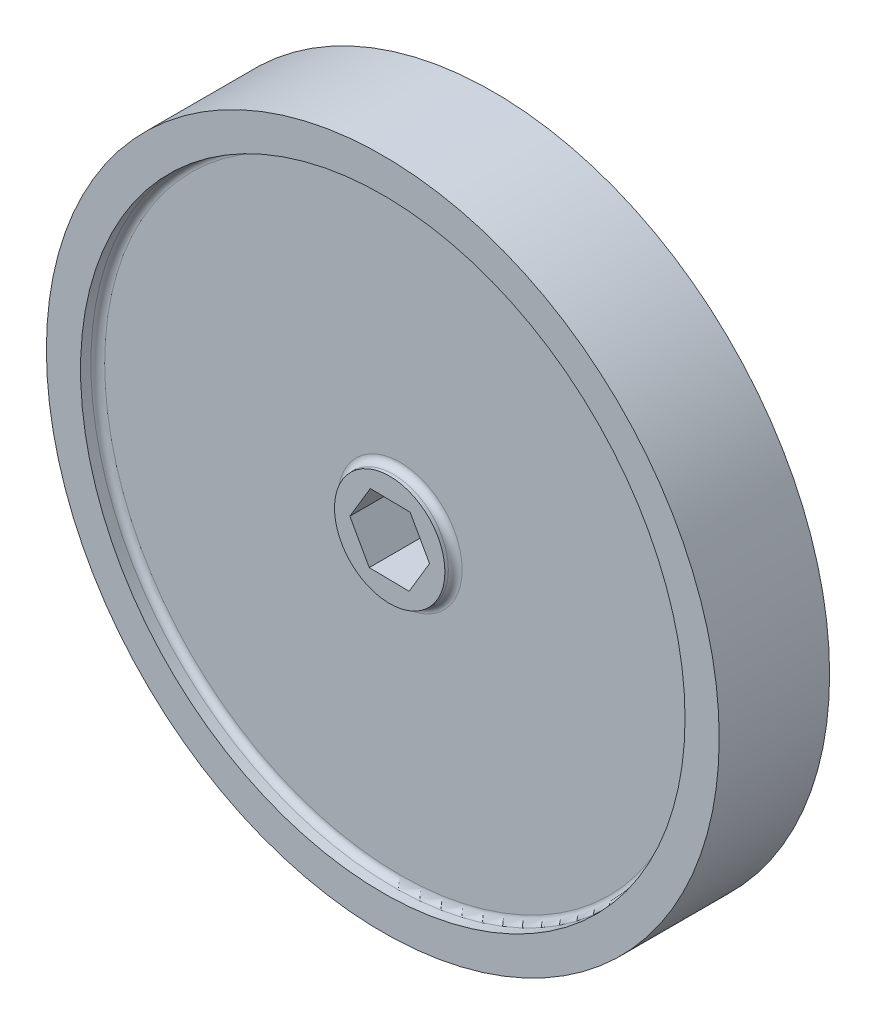
ISO-10303-21;
HEADER;
FILE_DESCRIPTION(('STEP AP214'),'2;1');
FILE_NAME('part.step','',(''),(''),'','','');
FILE_SCHEMA(('AUTOMOTIVE_DESIGN { 1 0 10303 214 1 1 1 1 }'));
ENDSEC;
DATA;
#1=APPLICATION_CONTEXT('core data for automotive mechanical design processes');
#2=APPLICATION_PROTOCOL_DEFINITION('international standard','automotive_design',2000,#1);
#3=PRODUCT_CONTEXT('',#1,'mechanical');
#4=PRODUCT('Part','Part','',(#3));
#5=PRODUCT_RELATED_PRODUCT_CATEGORY('part','',(#4));
#6=PRODUCT_DEFINITION_FORMATION('','',#4);
#7=PRODUCT_DEFINITION_CONTEXT('part definition',#1,'design');
#8=PRODUCT_DEFINITION('design','',#6,#7);
#9=PRODUCT_DEFINITION_SHAPE('','',#8);
#10=(LENGTH_UNIT() NAMED_UNIT(*) SI_UNIT(.MILLI.,.METRE.));
#11=(NAMED_UNIT(*) PLANE_ANGLE_UNIT() SI_UNIT($,.RADIAN.));
#12=(NAMED_UNIT(*) SI_UNIT($,.STERADIAN.) SOLID_ANGLE_UNIT());
#13=UNCERTAINTY_MEASURE_WITH_UNIT(LENGTH_MEASURE(1.E-05),#10,'distance_accuracy_value','');
#14=(GEOMETRIC_REPRESENTATION_CONTEXT(3) GLOBAL_UNCERTAINTY_ASSIGNED_CONTEXT((#13)) GLOBAL_UNIT_ASSIGNED_CONTEXT((#10,
#11,#12)) REPRESENTATION_CONTEXT('',''));
#15=CARTESIAN_POINT('',(0.,0.,0.));
#16=DIRECTION('',(0.,0.,1.));
#17=DIRECTION('',(1.,0.,0.));
#18=AXIS2_PLACEMENT_3D('',#15,#16,#17);
#19=CARTESIAN_POINT('',(-3.76226704796302,-6.29354272196074,20.32));
#20=DIRECTION('',(0.0151994247971552,0.999884482070722,0.));
#21=DIRECTION('',(-0.999884482070722,0.0151994247971552,0.));
#22=AXIS2_PLACEMENT_3D('',#19,#20,#21);
#23=PLANE('',#22);
#24=DIRECTION('',(0.,0.,-1.));
#25=VECTOR('',#24,1.);
#26=CARTESIAN_POINT('',(-3.76226704796302,-6.29354272196074,20.32));
#27=LINE('',#26,#25);
#28=CARTESIAN_POINT('',(-3.76226704796302,-6.29354272196074,19.05));
#29=VERTEX_POINT('',#28);
#30=CARTESIAN_POINT('',(-3.76226704796302,-6.29354272196074,1.27));
#31=VERTEX_POINT('',#30);
#32=EDGE_CURVE('E109',#29,#31,#27,.T.);
#33=ORIENTED_EDGE('',*,*,#32,.F.);
#34=DIRECTION('',(0.999884482070722,-0.0151994247971552,0.));
#35=VECTOR('',#34,1.);
#36=CARTESIAN_POINT('',(-3.76226704796302,-6.29354272196074,19.05));
#37=LINE('',#36,#35);
#38=CARTESIAN_POINT('',(3.56923435303915,-6.40499020033743,19.05));
#39=VERTEX_POINT('',#38);
#40=EDGE_CURVE('E54',#29,#39,#37,.T.);
#41=ORIENTED_EDGE('',*,*,#40,.T.);
#42=DIRECTION('',(0.,0.,-1.));
#43=VECTOR('',#42,1.);
#44=CARTESIAN_POINT('',(3.56923435303915,-6.40499020033743,20.32));
#45=LINE('',#44,#43);
#46=CARTESIAN_POINT('',(3.56923435303915,-6.40499020033743,1.27));
#47=VERTEX_POINT('',#46);
#48=EDGE_CURVE('E120',#39,#47,#45,.T.);
#49=ORIENTED_EDGE('',*,*,#48,.T.);
#50=DIRECTION('',(-0.999884482070722,0.0151994247971552,0.));
#51=VECTOR('',#50,1.);
#52=CARTESIAN_POINT('',(-3.76226704796302,-6.29354272196074,1.27));
#53=LINE('',#52,#51);
#54=EDGE_CURVE('E189',#47,#31,#53,.T.);
#55=ORIENTED_EDGE('',*,*,#54,.T.);
#56=EDGE_LOOP('',(#33,#41,#49,#55));
#57=FACE_BOUND('',#56,.T.);
#58=ADVANCED_FACE('F39',(#57),#23,.T.);
#59=CARTESIAN_POINT('',(3.56923435303915,-6.40499020033743,20.32));
#60=DIRECTION('',(-0.858325649924513,0.513105329032609,0.));
#61=DIRECTION('',(-0.513105329032609,-0.858325649924513,0.));
#62=AXIS2_PLACEMENT_3D('',#59,#60,#61);
#63=PLANE('',#62);
#64=ORIENTED_EDGE('',*,*,#48,.F.);
#65=DIRECTION('',(0.513105329032609,0.858325649924513,0.));
#66=VECTOR('',#65,1.);
#67=CARTESIAN_POINT('',(3.56923435303915,-6.40499020033743,19.05));
#68=LINE('',#67,#66);
#69=CARTESIAN_POINT('',(7.33150140100217,-0.1114474783767,19.05));
#70=VERTEX_POINT('',#69);
#71=EDGE_CURVE('E170',#39,#70,#68,.T.);
#72=ORIENTED_EDGE('',*,*,#71,.T.);
#73=DIRECTION('',(0.,0.,-1.));
#74=VECTOR('',#73,1.);
#75=CARTESIAN_POINT('',(7.33150140100217,-0.1114474783767,20.32));
#76=LINE('',#75,#74);
#77=CARTESIAN_POINT('',(7.33150140100217,-0.1114474783767,1.27));
#78=VERTEX_POINT('',#77);
#79=EDGE_CURVE('E118',#70,#78,#76,.T.);
#80=ORIENTED_EDGE('',*,*,#79,.T.);
#81=DIRECTION('',(-0.513105329032609,-0.858325649924513,0.));
#82=VECTOR('',#81,1.);
#83=CARTESIAN_POINT('',(3.56923435303915,-6.40499020033743,1.27));
#84=LINE('',#83,#82);
#85=EDGE_CURVE('E186',#78,#47,#84,.T.);
#86=ORIENTED_EDGE('',*,*,#85,.T.);
#87=EDGE_LOOP('',(#64,#72,#80,#86));
#88=FACE_BOUND('',#87,.T.);
#89=ADVANCED_FACE('F219',(#88),#63,.T.);
#90=CARTESIAN_POINT('',(7.33150140100217,-0.1114474783767,20.32));
#91=DIRECTION('',(-0.873525074721669,-0.486779153038114,0.));
#92=DIRECTION('',(0.486779153038114,-0.873525074721669,0.));
#93=AXIS2_PLACEMENT_3D('',#90,#91,#92);
#94=PLANE('',#93);
#95=ORIENTED_EDGE('',*,*,#79,.F.);
#96=DIRECTION('',(-0.486779153038114,0.873525074721669,0.));
#97=VECTOR('',#96,1.);
#98=CARTESIAN_POINT('',(7.33150140100217,-0.1114474783767,19.05));
#99=LINE('',#98,#97);
#100=CARTESIAN_POINT('',(3.76226704796302,6.29354272196073,19.05));
#101=VERTEX_POINT('',#100);
#102=EDGE_CURVE('E167',#70,#101,#99,.T.);
#103=ORIENTED_EDGE('',*,*,#102,.T.);
#104=DIRECTION('',(0.,0.,-1.));
#105=VECTOR('',#104,1.);
#106=CARTESIAN_POINT('',(3.76226704796302,6.29354272196073,20.32));
#107=LINE('',#106,#105);
#108=CARTESIAN_POINT('',(3.76226704796302,6.29354272196073,1.27));
#109=VERTEX_POINT('',#108);
#110=EDGE_CURVE('E111',#101,#109,#107,.T.);
#111=ORIENTED_EDGE('',*,*,#110,.T.);
#112=DIRECTION('',(0.486779153038114,-0.873525074721669,0.));
#113=VECTOR('',#112,1.);
#114=CARTESIAN_POINT('',(7.33150140100217,-0.1114474783767,1.27));
#115=LINE('',#114,#113);
#116=EDGE_CURVE('E183',#109,#78,#115,.T.);
#117=ORIENTED_EDGE('',*,*,#116,.T.);
#118=EDGE_LOOP('',(#95,#103,#111,#117));
#119=FACE_BOUND('',#118,.T.);
#120=ADVANCED_FACE('F225',(#119),#94,.T.);
#121=CARTESIAN_POINT('',(3.76226704796302,6.29354272196073,20.32));
#122=DIRECTION('',(-0.0151994247971554,-0.999884482070722,0.));
#123=DIRECTION('',(0.999884482070722,-0.0151994247971554,0.));
#124=AXIS2_PLACEMENT_3D('',#121,#122,#123);
#125=PLANE('',#124);
#126=ORIENTED_EDGE('',*,*,#110,.F.);
#127=DIRECTION('',(-0.999884482070722,0.0151994247971554,0.));
#128=VECTOR('',#127,1.);
#129=CARTESIAN_POINT('',(3.76226704796302,6.29354272196073,19.05));
#130=LINE('',#129,#128);
#131=CARTESIAN_POINT('',(-3.56923435303916,6.40499020033743,19.05));
#132=VERTEX_POINT('',#131);
#133=EDGE_CURVE('E103',#101,#132,#130,.T.);
#134=ORIENTED_EDGE('',*,*,#133,.T.);
#135=DIRECTION('',(0.,0.,-1.));
#136=VECTOR('',#135,1.);
#137=CARTESIAN_POINT('',(-3.56923435303916,6.40499020033743,20.32));
#138=LINE('',#137,#136);
#139=CARTESIAN_POINT('',(-3.56923435303916,6.40499020033743,1.27));
#140=VERTEX_POINT('',#139);
#141=EDGE_CURVE('E102',#132,#140,#138,.T.);
#142=ORIENTED_EDGE('',*,*,#141,.T.);
#143=DIRECTION('',(0.999884482070722,-0.0151994247971554,0.));
#144=VECTOR('',#143,1.);
#145=CARTESIAN_POINT('',(3.76226704796302,6.29354272196073,1.27));
#146=LINE('',#145,#144);
#147=EDGE_CURVE('E180',#140,#109,#146,.T.);
#148=ORIENTED_EDGE('',*,*,#147,.T.);
#149=EDGE_LOOP('',(#126,#134,#142,#148));
#150=FACE_BOUND('',#149,.T.);
#151=ADVANCED_FACE('F231',(#150),#125,.T.);
#152=CARTESIAN_POINT('',(-3.56923435303916,6.40499020033743,20.32));
#153=DIRECTION('',(0.858325649924514,-0.513105329032609,0.));
#154=DIRECTION('',(0.513105329032609,0.858325649924514,0.));
#155=AXIS2_PLACEMENT_3D('',#152,#153,#154);
#156=PLANE('',#155);
#157=ORIENTED_EDGE('',*,*,#141,.F.);
#158=DIRECTION('',(-0.513105329032609,-0.858325649924514,0.));
#159=VECTOR('',#158,1.);
#160=CARTESIAN_POINT('',(-3.56923435303916,6.40499020033743,19.05));
#161=LINE('',#160,#159);
#162=CARTESIAN_POINT('',(-7.33150140100217,0.111447478376703,19.05));
#163=VERTEX_POINT('',#162);
#164=EDGE_CURVE('E94',#132,#163,#161,.T.);
#165=ORIENTED_EDGE('',*,*,#164,.T.);
#166=DIRECTION('',(0.,0.,-1.));
#167=VECTOR('',#166,1.);
#168=CARTESIAN_POINT('',(-7.33150140100217,0.111447478376703,20.32));
#169=LINE('',#168,#167);
#170=CARTESIAN_POINT('',(-7.33150140100217,0.111447478376703,1.27));
#171=VERTEX_POINT('',#170);
#172=EDGE_CURVE('E62',#163,#171,#169,.T.);
#173=ORIENTED_EDGE('',*,*,#172,.T.);
#174=DIRECTION('',(0.513105329032609,0.858325649924514,0.));
#175=VECTOR('',#174,1.);
#176=CARTESIAN_POINT('',(-3.56923435303916,6.40499020033743,1.27));
#177=LINE('',#176,#175);
#178=EDGE_CURVE('E178',#171,#140,#177,.T.);
#179=ORIENTED_EDGE('',*,*,#178,.T.);
#180=EDGE_LOOP('',(#157,#165,#173,#179));
#181=FACE_BOUND('',#180,.T.);
#182=ADVANCED_FACE('F101',(#181),#156,.T.);
#183=CARTESIAN_POINT('',(-7.33150140100217,0.111447478376703,20.32));
#184=DIRECTION('',(0.873525074721669,0.486779153038113,0.));
#185=DIRECTION('',(-0.486779153038113,0.873525074721669,0.));
#186=AXIS2_PLACEMENT_3D('',#183,#184,#185);
#187=PLANE('',#186);
#188=ORIENTED_EDGE('',*,*,#172,.F.);
#189=DIRECTION('',(0.486779153038113,-0.873525074721669,0.));
#190=VECTOR('',#189,1.);
#191=CARTESIAN_POINT('',(-7.33150140100217,0.111447478376703,19.05));
#192=LINE('',#191,#190);
#193=EDGE_CURVE('E91',#163,#29,#192,.T.);
#194=ORIENTED_EDGE('',*,*,#193,.T.);
#195=ORIENTED_EDGE('',*,*,#32,.T.);
#196=DIRECTION('',(-0.486779153038113,0.873525074721669,0.));
#197=VECTOR('',#196,1.);
#198=CARTESIAN_POINT('',(-7.33150140100217,0.111447478376703,1.27));
#199=LINE('',#198,#197);
#200=EDGE_CURVE('E108',#31,#171,#199,.T.);
#201=ORIENTED_EDGE('',*,*,#200,.T.);
#202=EDGE_LOOP('',(#188,#194,#195,#201));
#203=FACE_BOUND('',#202,.T.);
#204=ADVANCED_FACE('F106',(#203),#187,.T.);
#205=CARTESIAN_POINT('',(0.,0.,17.145));
#206=DIRECTION('',(0.,0.,1.));
#207=DIRECTION('',(1.,0.,0.));
#208=AXIS2_PLACEMENT_3D('',#205,#206,#207);
#209=CYLINDRICAL_SURFACE('',#208,10.16);
#210=CARTESIAN_POINT('',(0.,0.,18.415));
#211=DIRECTION('',(0.,0.,1.));
#212=DIRECTION('',(1.,0.,0.));
#213=AXIS2_PLACEMENT_3D('',#210,#211,#212);
#214=CIRCLE('',#213,10.16);
#215=CARTESIAN_POINT('',(10.16,0.,18.415));
#216=VERTEX_POINT('',#215);
#217=EDGE_CURVE('E140',#216,#216,#214,.T.);
#218=ORIENTED_EDGE('',*,*,#217,.T.);
#219=EDGE_LOOP('',(#218));
#220=FACE_BOUND('',#219,.T.);
#221=CARTESIAN_POINT('',(0.,0.,19.05));
#222=DIRECTION('',(0.,0.,1.));
#223=DIRECTION('',(1.,0.,0.));
#224=AXIS2_PLACEMENT_3D('',#221,#222,#223);
#225=CIRCLE('',#224,10.16);
#226=CARTESIAN_POINT('',(10.16,0.,19.05));
#227=VERTEX_POINT('',#226);
#228=EDGE_CURVE('E98',#227,#227,#225,.T.);
#229=ORIENTED_EDGE('',*,*,#228,.F.);
#230=EDGE_LOOP('',(#229));
#231=FACE_BOUND('',#230,.T.);
#232=ADVANCED_FACE('F157',(#220,#231),#209,.T.);
#233=CARTESIAN_POINT('',(0.,0.,3.175));
#234=DIRECTION('',(0.,0.,-1.));
#235=DIRECTION('',(-1.,0.,0.));
#236=AXIS2_PLACEMENT_3D('',#233,#234,#235);
#237=CYLINDRICAL_SURFACE('',#236,10.16);
#238=CARTESIAN_POINT('',(0.,0.,1.905));
#239=DIRECTION('',(0.,0.,-1.));
#240=DIRECTION('',(-1.,0.,0.));
#241=AXIS2_PLACEMENT_3D('',#238,#239,#240);
#242=CIRCLE('',#241,10.16);
#243=CARTESIAN_POINT('',(-10.16,0.,1.905));
#244=VERTEX_POINT('',#243);
#245=EDGE_CURVE('E126',#244,#244,#242,.T.);
#246=ORIENTED_EDGE('',*,*,#245,.T.);
#247=EDGE_LOOP('',(#246));
#248=FACE_BOUND('',#247,.T.);
#249=CARTESIAN_POINT('',(0.,0.,1.27));
#250=DIRECTION('',(0.,0.,-1.));
#251=DIRECTION('',(-1.,0.,0.));
#252=AXIS2_PLACEMENT_3D('',#249,#250,#251);
#253=CIRCLE('',#252,10.16);
#254=CARTESIAN_POINT('',(-10.16,0.,1.27));
#255=VERTEX_POINT('',#254);
#256=EDGE_CURVE('E174',#255,#255,#253,.T.);
#257=ORIENTED_EDGE('',*,*,#256,.F.);
#258=EDGE_LOOP('',(#257));
#259=FACE_BOUND('',#258,.T.);
#260=ADVANCED_FACE('F160',(#248,#259),#237,.T.);
#261=CARTESIAN_POINT('',(0.,0.,20.32));
#262=DIRECTION('',(0.,0.,1.));
#263=DIRECTION('',(1.,0.,0.));
#264=AXIS2_PLACEMENT_3D('',#261,#262,#263);
#265=PLANE('',#264);
#266=CARTESIAN_POINT('',(0.,0.,20.32));
#267=DIRECTION('',(0.,0.,1.));
#268=DIRECTION('',(1.,0.,0.));
#269=AXIS2_PLACEMENT_3D('',#266,#267,#268);
#270=CIRCLE('',#269,55.626);
#271=CARTESIAN_POINT('',(55.626,0.,20.32));
#272=VERTEX_POINT('',#271);
#273=EDGE_CURVE('E113',#272,#272,#270,.T.);
#274=ORIENTED_EDGE('',*,*,#273,.F.);
#275=EDGE_LOOP('',(#274));
#276=FACE_BOUND('',#275,.T.);
#277=CARTESIAN_POINT('',(0.,0.,20.32));
#278=DIRECTION('',(0.,0.,1.));
#279=DIRECTION('',(1.,0.,0.));
#280=AXIS2_PLACEMENT_3D('',#277,#278,#279);
#281=CIRCLE('',#280,61.9125);
#282=CARTESIAN_POINT('',(61.9125,0.,20.32));
#283=VERTEX_POINT('',#282);
#284=EDGE_CURVE('E123',#283,#283,#281,.T.);
#285=ORIENTED_EDGE('',*,*,#284,.T.);
#286=EDGE_LOOP('',(#285));
#287=FACE_BOUND('',#286,.T.);
#288=ADVANCED_FACE('F199',(#276,#287),#265,.T.);
#289=CARTESIAN_POINT('',(0.,0.,0.));
#290=DIRECTION('',(0.,0.,1.));
#291=DIRECTION('',(1.,0.,0.));
#292=AXIS2_PLACEMENT_3D('',#289,#290,#291);
#293=PLANE('',#292);
#294=CARTESIAN_POINT('',(0.,0.,0.));
#295=DIRECTION('',(0.,0.,-1.));
#296=DIRECTION('',(-1.,0.,0.));
#297=AXIS2_PLACEMENT_3D('',#294,#295,#296);
#298=CIRCLE('',#297,55.626);
#299=CARTESIAN_POINT('',(-55.626,0.,0.));
#300=VERTEX_POINT('',#299);
#301=EDGE_CURVE('E192',#300,#300,#298,.T.);
#302=ORIENTED_EDGE('',*,*,#301,.F.);
#303=EDGE_LOOP('',(#302));
#304=FACE_BOUND('',#303,.T.);
#305=CARTESIAN_POINT('',(0.,0.,0.));
#306=DIRECTION('',(0.,0.,1.));
#307=DIRECTION('',(1.,0.,0.));
#308=AXIS2_PLACEMENT_3D('',#305,#306,#307);
#309=CIRCLE('',#308,61.9125);
#310=CARTESIAN_POINT('',(61.9125,0.,0.));
#311=VERTEX_POINT('',#310);
#312=EDGE_CURVE('E122',#311,#311,#309,.T.);
#313=ORIENTED_EDGE('',*,*,#312,.F.);
#314=EDGE_LOOP('',(#313));
#315=FACE_BOUND('',#314,.T.);
#316=ADVANCED_FACE('F202',(#304,#315),#293,.F.);
#317=CARTESIAN_POINT('',(0.,0.,20.32));
#318=DIRECTION('',(0.,0.,-1.));
#319=DIRECTION('',(-1.,0.,0.));
#320=AXIS2_PLACEMENT_3D('',#317,#318,#319);
#321=CYLINDRICAL_SURFACE('',#320,61.9125);
#322=ORIENTED_EDGE('',*,*,#284,.F.);
#323=EDGE_LOOP('',(#322));
#324=FACE_BOUND('',#323,.T.);
#325=ORIENTED_EDGE('',*,*,#312,.T.);
#326=EDGE_LOOP('',(#325));
#327=FACE_BOUND('',#326,.T.);
#328=ADVANCED_FACE('F206',(#324,#327),#321,.T.);
#329=CARTESIAN_POINT('',(0.,0.,17.145));
#330=DIRECTION('',(0.,0.,1.));
#331=DIRECTION('',(1.,0.,0.));
#332=AXIS2_PLACEMENT_3D('',#329,#330,#331);
#333=CYLINDRICAL_SURFACE('',#332,55.626);
#334=CARTESIAN_POINT('',(0.,0.,18.415));
#335=DIRECTION('',(0.,0.,1.));
#336=DIRECTION('',(1.,0.,0.));
#337=AXIS2_PLACEMENT_3D('',#334,#335,#336);
#338=CIRCLE('',#337,55.626);
#339=CARTESIAN_POINT('',(55.626,0.,18.415));
#340=VERTEX_POINT('',#339);
#341=EDGE_CURVE('E11',#340,#340,#338,.F.);
#342=ORIENTED_EDGE('',*,*,#341,.T.);
#343=EDGE_LOOP('',(#342));
#344=FACE_BOUND('',#343,.T.);
#345=ORIENTED_EDGE('',*,*,#273,.T.);
#346=EDGE_LOOP('',(#345));
#347=FACE_BOUND('',#346,.T.);
#348=ADVANCED_FACE('F197',(#344,#347),#333,.F.);
#349=CARTESIAN_POINT('',(0.,0.,17.145));
#350=DIRECTION('',(0.,0.,1.));
#351=DIRECTION('',(1.,0.,0.));
#352=AXIS2_PLACEMENT_3D('',#349,#350,#351);
#353=PLANE('',#352);
#354=CARTESIAN_POINT('',(0.,0.,17.145));
#355=DIRECTION('',(0.,0.,1.));
#356=DIRECTION('',(1.,0.,0.));
#357=AXIS2_PLACEMENT_3D('',#354,#355,#356);
#358=CIRCLE('',#357,11.43);
#359=CARTESIAN_POINT('',(11.43,0.,17.145));
#360=VERTEX_POINT('',#359);
#361=EDGE_CURVE('E47',#360,#360,#358,.F.);
#362=ORIENTED_EDGE('',*,*,#361,.T.);
#363=EDGE_LOOP('',(#362));
#364=FACE_BOUND('',#363,.T.);
#365=CARTESIAN_POINT('',(0.,0.,17.145));
#366=DIRECTION('',(0.,0.,1.));
#367=DIRECTION('',(1.,0.,0.));
#368=AXIS2_PLACEMENT_3D('',#365,#366,#367);
#369=CIRCLE('',#368,54.356);
#370=CARTESIAN_POINT('',(54.356,0.,17.145));
#371=VERTEX_POINT('',#370);
#372=EDGE_CURVE('E143',#371,#371,#369,.T.);
#373=ORIENTED_EDGE('',*,*,#372,.T.);
#374=EDGE_LOOP('',(#373));
#375=FACE_BOUND('',#374,.T.);
#376=ADVANCED_FACE('F148',(#364,#375),#353,.T.);
#377=CARTESIAN_POINT('',(0.,0.,3.175));
#378=DIRECTION('',(0.,0.,-1.));
#379=DIRECTION('',(-1.,0.,0.));
#380=AXIS2_PLACEMENT_3D('',#377,#378,#379);
#381=CYLINDRICAL_SURFACE('',#380,55.626);
#382=CARTESIAN_POINT('',(0.,0.,1.905));
#383=DIRECTION('',(0.,0.,-1.));
#384=DIRECTION('',(-1.,0.,0.));
#385=AXIS2_PLACEMENT_3D('',#382,#383,#384);
#386=CIRCLE('',#385,55.626);
#387=CARTESIAN_POINT('',(-55.626,0.,1.905));
#388=VERTEX_POINT('',#387);
#389=EDGE_CURVE('E137',#388,#388,#386,.F.);
#390=ORIENTED_EDGE('',*,*,#389,.T.);
#391=EDGE_LOOP('',(#390));
#392=FACE_BOUND('',#391,.T.);
#393=ORIENTED_EDGE('',*,*,#301,.T.);
#394=EDGE_LOOP('',(#393));
#395=FACE_BOUND('',#394,.T.);
#396=ADVANCED_FACE('F244',(#392,#395),#381,.F.);
#397=CARTESIAN_POINT('',(0.,0.,3.175));
#398=DIRECTION('',(0.,0.,-1.));
#399=DIRECTION('',(-1.,0.,0.));
#400=AXIS2_PLACEMENT_3D('',#397,#398,#399);
#401=PLANE('',#400);
#402=CARTESIAN_POINT('',(0.,0.,3.175));
#403=DIRECTION('',(0.,0.,-1.));
#404=DIRECTION('',(-1.,0.,0.));
#405=AXIS2_PLACEMENT_3D('',#402,#403,#404);
#406=CIRCLE('',#405,11.43);
#407=CARTESIAN_POINT('',(-11.43,0.,3.175));
#408=VERTEX_POINT('',#407);
#409=EDGE_CURVE('E134',#408,#408,#406,.F.);
#410=ORIENTED_EDGE('',*,*,#409,.T.);
#411=EDGE_LOOP('',(#410));
#412=FACE_BOUND('',#411,.T.);
#413=CARTESIAN_POINT('',(0.,0.,3.175));
#414=DIRECTION('',(0.,0.,-1.));
#415=DIRECTION('',(-1.,0.,0.));
#416=AXIS2_PLACEMENT_3D('',#413,#414,#415);
#417=CIRCLE('',#416,54.356);
#418=CARTESIAN_POINT('',(-54.356,0.,3.175));
#419=VERTEX_POINT('',#418);
#420=EDGE_CURVE('E131',#419,#419,#417,.T.);
#421=ORIENTED_EDGE('',*,*,#420,.T.);
#422=EDGE_LOOP('',(#421));
#423=FACE_BOUND('',#422,.T.);
#424=ADVANCED_FACE('F248',(#412,#423),#401,.T.);
#425=CARTESIAN_POINT('',(0.,0.,1.27));
#426=DIRECTION('',(0.,0.,-1.));
#427=DIRECTION('',(-1.,0.,0.));
#428=AXIS2_PLACEMENT_3D('',#425,#426,#427);
#429=PLANE('',#428);
#430=ORIENTED_EDGE('',*,*,#85,.F.);
#431=ORIENTED_EDGE('',*,*,#116,.F.);
#432=ORIENTED_EDGE('',*,*,#147,.F.);
#433=ORIENTED_EDGE('',*,*,#178,.F.);
#434=ORIENTED_EDGE('',*,*,#200,.F.);
#435=ORIENTED_EDGE('',*,*,#54,.F.);
#436=EDGE_LOOP('',(#430,#431,#432,#433,#434,#435));
#437=FACE_BOUND('',#436,.T.);
#438=ORIENTED_EDGE('',*,*,#256,.T.);
#439=EDGE_LOOP('',(#438));
#440=FACE_BOUND('',#439,.T.);
#441=ADVANCED_FACE('F252',(#437,#440),#429,.T.);
#442=CARTESIAN_POINT('',(0.,0.,19.05));
#443=DIRECTION('',(0.,0.,1.));
#444=DIRECTION('',(1.,0.,0.));
#445=AXIS2_PLACEMENT_3D('',#442,#443,#444);
#446=PLANE('',#445);
#447=ORIENTED_EDGE('',*,*,#193,.F.);
#448=ORIENTED_EDGE('',*,*,#164,.F.);
#449=ORIENTED_EDGE('',*,*,#133,.F.);
#450=ORIENTED_EDGE('',*,*,#102,.F.);
#451=ORIENTED_EDGE('',*,*,#71,.F.);
#452=ORIENTED_EDGE('',*,*,#40,.F.);
#453=EDGE_LOOP('',(#447,#448,#449,#450,#451,#452));
#454=FACE_BOUND('',#453,.T.);
#455=ORIENTED_EDGE('',*,*,#228,.T.);
#456=EDGE_LOOP('',(#455));
#457=FACE_BOUND('',#456,.T.);
#458=ADVANCED_FACE('F92',(#454,#457),#446,.T.);
#459=CARTESIAN_POINT('',(0.,0.,1.905));
#460=DIRECTION('',(0.,0.,-1.));
#461=DIRECTION('',(-1.,0.,0.));
#462=AXIS2_PLACEMENT_3D('',#459,#460,#461);
#463=TOROIDAL_SURFACE('',#462,11.43,1.27);
#464=ORIENTED_EDGE('',*,*,#409,.F.);
#465=EDGE_LOOP('',(#464));
#466=FACE_BOUND('',#465,.T.);
#467=ORIENTED_EDGE('',*,*,#245,.F.);
#468=EDGE_LOOP('',(#467));
#469=FACE_BOUND('',#468,.T.);
#470=ADVANCED_FACE('F261',(#466,#469),#463,.F.);
#471=CARTESIAN_POINT('',(0.,0.,1.905));
#472=DIRECTION('',(0.,0.,-1.));
#473=DIRECTION('',(-1.,0.,0.));
#474=AXIS2_PLACEMENT_3D('',#471,#472,#473);
#475=TOROIDAL_SURFACE('',#474,54.356,1.27);
#476=ORIENTED_EDGE('',*,*,#389,.F.);
#477=EDGE_LOOP('',(#476));
#478=FACE_BOUND('',#477,.T.);
#479=ORIENTED_EDGE('',*,*,#420,.F.);
#480=EDGE_LOOP('',(#479));
#481=FACE_BOUND('',#480,.T.);
#482=ADVANCED_FACE('F154',(#478,#481),#475,.F.);
#483=CARTESIAN_POINT('',(0.,0.,18.415));
#484=DIRECTION('',(0.,0.,1.));
#485=DIRECTION('',(1.,0.,0.));
#486=AXIS2_PLACEMENT_3D('',#483,#484,#485);
#487=TOROIDAL_SURFACE('',#486,11.43,1.27);
#488=ORIENTED_EDGE('',*,*,#361,.F.);
#489=EDGE_LOOP('',(#488));
#490=FACE_BOUND('',#489,.T.);
#491=ORIENTED_EDGE('',*,*,#217,.F.);
#492=EDGE_LOOP('',(#491));
#493=FACE_BOUND('',#492,.T.);
#494=ADVANCED_FACE('F151',(#490,#493),#487,.F.);
#495=CARTESIAN_POINT('',(0.,0.,18.415));
#496=DIRECTION('',(0.,0.,1.));
#497=DIRECTION('',(1.,0.,0.));
#498=AXIS2_PLACEMENT_3D('',#495,#496,#497);
#499=TOROIDAL_SURFACE('',#498,54.356,1.27);
#500=ORIENTED_EDGE('',*,*,#341,.F.);
#501=EDGE_LOOP('',(#500));
#502=FACE_BOUND('',#501,.T.);
#503=ORIENTED_EDGE('',*,*,#372,.F.);
#504=EDGE_LOOP('',(#503));
#505=FACE_BOUND('',#504,.T.);
#506=ADVANCED_FACE('F41',(#502,#505),#499,.F.);
#507=CLOSED_SHELL('',(#58,#89,#120,#151,#182,#204,#232,#260,#288,#316,#328,#348,#376,#396,#424,
#441,#458,#470,#482,#494,#506));
#508=MANIFOLD_SOLID_BREP('B2',#507);
#509=ADVANCED_BREP_SHAPE_REPRESENTATION('',(#18,#508),#14);
#510=SHAPE_DEFINITION_REPRESENTATION(#9,#509);
ENDSEC;
END-ISO-10303-21;
